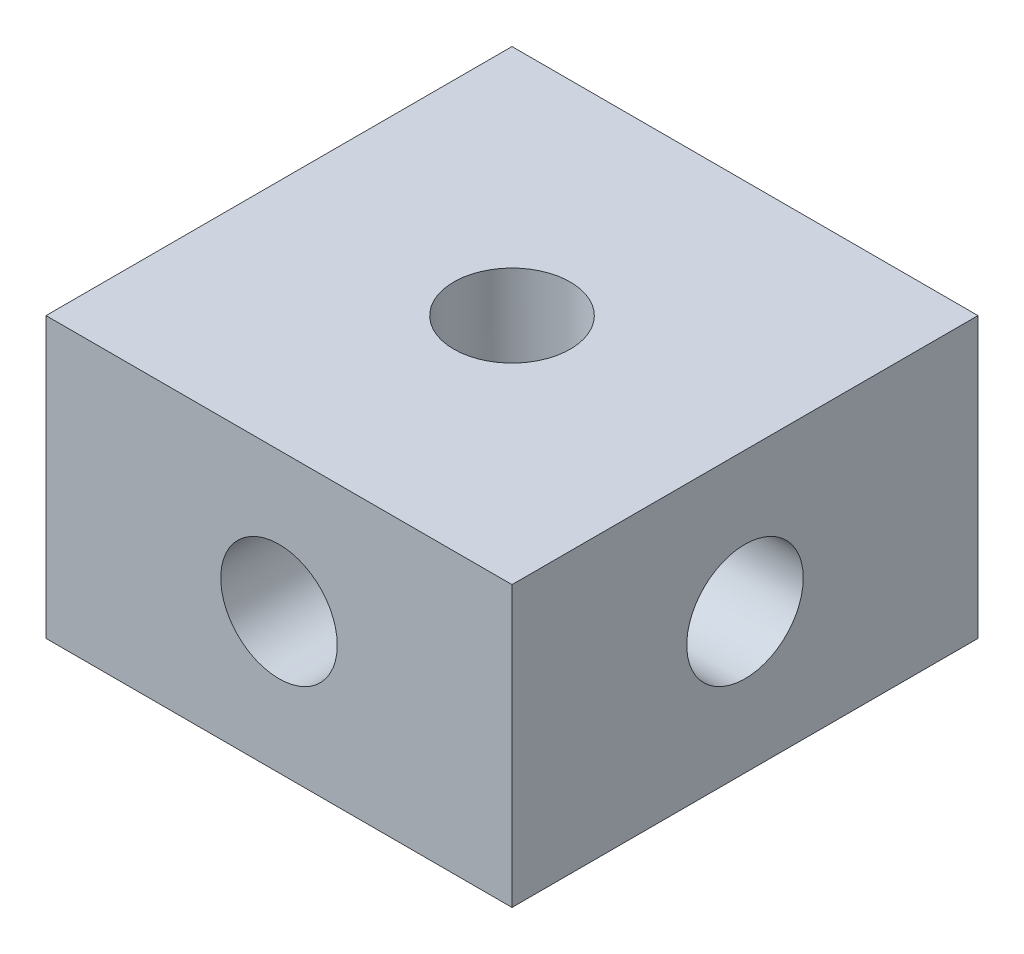
ISO-10303-21;
HEADER;
FILE_DESCRIPTION(('STEP AP214'),'2;1');
FILE_NAME('part.step','',(''),(''),'','','');
FILE_SCHEMA(('AUTOMOTIVE_DESIGN { 1 0 10303 214 1 1 1 1 }'));
ENDSEC;
DATA;
#1=APPLICATION_CONTEXT('core data for automotive mechanical design processes');
#2=APPLICATION_PROTOCOL_DEFINITION('international standard','automotive_design',2000,#1);
#3=PRODUCT_CONTEXT('',#1,'mechanical');
#4=PRODUCT('Part','Part','',(#3));
#5=PRODUCT_RELATED_PRODUCT_CATEGORY('part','',(#4));
#6=PRODUCT_DEFINITION_FORMATION('','',#4);
#7=PRODUCT_DEFINITION_CONTEXT('part definition',#1,'design');
#8=PRODUCT_DEFINITION('design','',#6,#7);
#9=PRODUCT_DEFINITION_SHAPE('','',#8);
#10=(LENGTH_UNIT() NAMED_UNIT(*) SI_UNIT(.MILLI.,.METRE.));
#11=(NAMED_UNIT(*) PLANE_ANGLE_UNIT() SI_UNIT($,.RADIAN.));
#12=(NAMED_UNIT(*) SI_UNIT($,.STERADIAN.) SOLID_ANGLE_UNIT());
#13=UNCERTAINTY_MEASURE_WITH_UNIT(LENGTH_MEASURE(1.E-05),#10,'distance_accuracy_value','');
#14=(GEOMETRIC_REPRESENTATION_CONTEXT(3) GLOBAL_UNCERTAINTY_ASSIGNED_CONTEXT((#13)) GLOBAL_UNIT_ASSIGNED_CONTEXT((#10,
#11,#12)) REPRESENTATION_CONTEXT('',''));
#15=CARTESIAN_POINT('',(0.,0.,0.));
#16=DIRECTION('',(0.,0.,1.));
#17=DIRECTION('',(1.,0.,0.));
#18=AXIS2_PLACEMENT_3D('',#15,#16,#17);
#19=CARTESIAN_POINT('',(0.,-3.,0.));
#20=DIRECTION('',(0.,1.,0.));
#21=DIRECTION('',(0.,0.,1.));
#22=AXIS2_PLACEMENT_3D('',#19,#20,#21);
#23=CYLINDRICAL_SURFACE('',#22,1.25);
#24=CARTESIAN_POINT('',(0.,3.,0.));
#25=DIRECTION('',(0.,1.,0.));
#26=DIRECTION('',(0.,0.,1.));
#27=AXIS2_PLACEMENT_3D('',#24,#25,#26);
#28=CIRCLE('',#27,1.25);
#29=CARTESIAN_POINT('',(0.,3.,1.25));
#30=VERTEX_POINT('',#29);
#31=EDGE_CURVE('E154',#30,#30,#28,.T.);
#32=ORIENTED_EDGE('',*,*,#31,.T.);
#33=EDGE_LOOP('',(#32));
#34=FACE_BOUND('',#33,.T.);
#35=CARTESIAN_POINT('',(0.,0.,0.));
#36=DIRECTION('',(0.,0.707106781186547,-0.707106781186547));
#37=DIRECTION('',(0.,0.707106781186547,0.707106781186547));
#38=AXIS2_PLACEMENT_3D('',#35,#36,#37);
#39=ELLIPSE('',#38,1.76776695296637,1.25);
#40=CARTESIAN_POINT('',(0.883883476483184,0.883883476483184,0.883883476483184));
#41=VERTEX_POINT('',#40);
#42=CARTESIAN_POINT('',(-0.883883476483184,0.883883476483184,0.883883476483184));
#43=VERTEX_POINT('',#42);
#44=EDGE_CURVE('E111',#41,#43,#39,.F.);
#45=ORIENTED_EDGE('',*,*,#44,.T.);
#46=CARTESIAN_POINT('',(0.,0.,0.));
#47=DIRECTION('',(0.707106781186547,0.707106781186547,0.));
#48=DIRECTION('',(-0.707106781186547,0.707106781186547,0.));
#49=AXIS2_PLACEMENT_3D('',#46,#47,#48);
#50=ELLIPSE('',#49,1.76776695296637,1.25);
#51=CARTESIAN_POINT('',(-0.883883476483184,0.883883476483184,-0.883883476483184));
#52=VERTEX_POINT('',#51);
#53=EDGE_CURVE('E100',#43,#52,#50,.F.);
#54=ORIENTED_EDGE('',*,*,#53,.T.);
#55=CARTESIAN_POINT('',(0.,0.,0.));
#56=DIRECTION('',(0.,0.707106781186547,0.707106781186547));
#57=DIRECTION('',(0.,0.707106781186547,-0.707106781186547));
#58=AXIS2_PLACEMENT_3D('',#55,#56,#57);
#59=ELLIPSE('',#58,1.76776695296637,1.25);
#60=CARTESIAN_POINT('',(0.883883476483184,0.883883476483184,-0.883883476483184));
#61=VERTEX_POINT('',#60);
#62=EDGE_CURVE('E106',#52,#61,#59,.F.);
#63=ORIENTED_EDGE('',*,*,#62,.T.);
#64=CARTESIAN_POINT('',(0.,0.,0.));
#65=DIRECTION('',(-0.707106781186547,0.707106781186547,0.));
#66=DIRECTION('',(0.707106781186547,0.707106781186547,0.));
#67=AXIS2_PLACEMENT_3D('',#64,#65,#66);
#68=ELLIPSE('',#67,1.76776695296637,1.25);
#69=EDGE_CURVE('E52',#61,#41,#68,.F.);
#70=ORIENTED_EDGE('',*,*,#69,.T.);
#71=EDGE_LOOP('',(#45,#54,#63,#70));
#72=FACE_BOUND('',#71,.T.);
#73=ADVANCED_FACE('F37',(#34,#72),#23,.F.);
#74=CARTESIAN_POINT('',(5.,3.,5.));
#75=DIRECTION('',(-1.,0.,0.));
#76=DIRECTION('',(0.,0.,1.));
#77=AXIS2_PLACEMENT_3D('',#74,#75,#76);
#78=PLANE('',#77);
#79=CARTESIAN_POINT('',(5.,0.,0.));
#80=DIRECTION('',(1.,0.,0.));
#81=DIRECTION('',(0.,0.,-1.));
#82=AXIS2_PLACEMENT_3D('',#79,#80,#81);
#83=CIRCLE('',#82,1.25);
#84=CARTESIAN_POINT('',(5.,0.,-1.25));
#85=VERTEX_POINT('',#84);
#86=EDGE_CURVE('E175',#85,#85,#83,.T.);
#87=ORIENTED_EDGE('',*,*,#86,.F.);
#88=EDGE_LOOP('',(#87));
#89=FACE_BOUND('',#88,.T.);
#90=DIRECTION('',(0.,0.,-1.));
#91=VECTOR('',#90,1.);
#92=CARTESIAN_POINT('',(5.,-3.,5.));
#93=LINE('',#92,#91);
#94=CARTESIAN_POINT('',(5.,-3.,5.));
#95=VERTEX_POINT('',#94);
#96=CARTESIAN_POINT('',(5.,-3.,-5.));
#97=VERTEX_POINT('',#96);
#98=EDGE_CURVE('E143',#95,#97,#93,.T.);
#99=ORIENTED_EDGE('',*,*,#98,.T.);
#100=DIRECTION('',(0.,-1.,0.));
#101=VECTOR('',#100,1.);
#102=CARTESIAN_POINT('',(5.,3.,-5.));
#103=LINE('',#102,#101);
#104=CARTESIAN_POINT('',(5.,3.,-5.));
#105=VERTEX_POINT('',#104);
#106=EDGE_CURVE('E123',#105,#97,#103,.T.);
#107=ORIENTED_EDGE('',*,*,#106,.F.);
#108=DIRECTION('',(0.,0.,-1.));
#109=VECTOR('',#108,1.);
#110=CARTESIAN_POINT('',(5.,3.,5.));
#111=LINE('',#110,#109);
#112=CARTESIAN_POINT('',(5.,3.,5.));
#113=VERTEX_POINT('',#112);
#114=EDGE_CURVE('E138',#113,#105,#111,.T.);
#115=ORIENTED_EDGE('',*,*,#114,.F.);
#116=DIRECTION('',(0.,-1.,0.));
#117=VECTOR('',#116,1.);
#118=CARTESIAN_POINT('',(5.,3.,5.));
#119=LINE('',#118,#117);
#120=EDGE_CURVE('E132',#113,#95,#119,.T.);
#121=ORIENTED_EDGE('',*,*,#120,.T.);
#122=EDGE_LOOP('',(#99,#107,#115,#121));
#123=FACE_BOUND('',#122,.T.);
#124=ADVANCED_FACE('F39',(#89,#123),#78,.F.);
#125=CARTESIAN_POINT('',(-5.,3.,-5.));
#126=DIRECTION('',(0.,0.,1.));
#127=DIRECTION('',(1.,0.,0.));
#128=AXIS2_PLACEMENT_3D('',#125,#126,#127);
#129=PLANE('',#128);
#130=CARTESIAN_POINT('',(0.,0.,-5.));
#131=DIRECTION('',(0.,0.,1.));
#132=DIRECTION('',(1.,0.,0.));
#133=AXIS2_PLACEMENT_3D('',#130,#131,#132);
#134=CIRCLE('',#133,1.25);
#135=CARTESIAN_POINT('',(1.25,0.,-5.));
#136=VERTEX_POINT('',#135);
#137=EDGE_CURVE('E157',#136,#136,#134,.T.);
#138=ORIENTED_EDGE('',*,*,#137,.T.);
#139=EDGE_LOOP('',(#138));
#140=FACE_BOUND('',#139,.T.);
#141=DIRECTION('',(-1.,0.,0.));
#142=VECTOR('',#141,1.);
#143=CARTESIAN_POINT('',(-5.,-3.,-5.));
#144=LINE('',#143,#142);
#145=CARTESIAN_POINT('',(-5.,-3.,-5.));
#146=VERTEX_POINT('',#145);
#147=EDGE_CURVE('E141',#97,#146,#144,.T.);
#148=ORIENTED_EDGE('',*,*,#147,.T.);
#149=DIRECTION('',(0.,-1.,0.));
#150=VECTOR('',#149,1.);
#151=CARTESIAN_POINT('',(-5.,3.,-5.));
#152=LINE('',#151,#150);
#153=CARTESIAN_POINT('',(-5.,3.,-5.));
#154=VERTEX_POINT('',#153);
#155=EDGE_CURVE('E126',#154,#146,#152,.T.);
#156=ORIENTED_EDGE('',*,*,#155,.F.);
#157=DIRECTION('',(-1.,0.,0.));
#158=VECTOR('',#157,1.);
#159=CARTESIAN_POINT('',(-5.,3.,-5.));
#160=LINE('',#159,#158);
#161=EDGE_CURVE('E150',#105,#154,#160,.T.);
#162=ORIENTED_EDGE('',*,*,#161,.F.);
#163=ORIENTED_EDGE('',*,*,#106,.T.);
#164=EDGE_LOOP('',(#148,#156,#162,#163));
#165=FACE_BOUND('',#164,.T.);
#166=ADVANCED_FACE('F202',(#140,#165),#129,.F.);
#167=CARTESIAN_POINT('',(-5.,3.,5.));
#168=DIRECTION('',(1.,0.,0.));
#169=DIRECTION('',(0.,0.,-1.));
#170=AXIS2_PLACEMENT_3D('',#167,#168,#169);
#171=PLANE('',#170);
#172=CARTESIAN_POINT('',(-5.,0.,0.));
#173=DIRECTION('',(1.,0.,0.));
#174=DIRECTION('',(0.,0.,-1.));
#175=AXIS2_PLACEMENT_3D('',#172,#173,#174);
#176=CIRCLE('',#175,1.25);
#177=CARTESIAN_POINT('',(-5.,0.,-1.25));
#178=VERTEX_POINT('',#177);
#179=EDGE_CURVE('E174',#178,#178,#176,.T.);
#180=ORIENTED_EDGE('',*,*,#179,.T.);
#181=EDGE_LOOP('',(#180));
#182=FACE_BOUND('',#181,.T.);
#183=DIRECTION('',(0.,0.,1.));
#184=VECTOR('',#183,1.);
#185=CARTESIAN_POINT('',(-5.,-3.,5.));
#186=LINE('',#185,#184);
#187=CARTESIAN_POINT('',(-5.,-3.,5.));
#188=VERTEX_POINT('',#187);
#189=EDGE_CURVE('E139',#146,#188,#186,.T.);
#190=ORIENTED_EDGE('',*,*,#189,.T.);
#191=DIRECTION('',(0.,-1.,0.));
#192=VECTOR('',#191,1.);
#193=CARTESIAN_POINT('',(-5.,3.,5.));
#194=LINE('',#193,#192);
#195=CARTESIAN_POINT('',(-5.,3.,5.));
#196=VERTEX_POINT('',#195);
#197=EDGE_CURVE('E129',#196,#188,#194,.T.);
#198=ORIENTED_EDGE('',*,*,#197,.F.);
#199=DIRECTION('',(0.,0.,1.));
#200=VECTOR('',#199,1.);
#201=CARTESIAN_POINT('',(-5.,3.,5.));
#202=LINE('',#201,#200);
#203=EDGE_CURVE('E148',#154,#196,#202,.T.);
#204=ORIENTED_EDGE('',*,*,#203,.F.);
#205=ORIENTED_EDGE('',*,*,#155,.T.);
#206=EDGE_LOOP('',(#190,#198,#204,#205));
#207=FACE_BOUND('',#206,.T.);
#208=ADVANCED_FACE('F181',(#182,#207),#171,.F.);
#209=CARTESIAN_POINT('',(-5.,3.,5.));
#210=DIRECTION('',(0.,0.,-1.));
#211=DIRECTION('',(-1.,0.,0.));
#212=AXIS2_PLACEMENT_3D('',#209,#210,#211);
#213=PLANE('',#212);
#214=CARTESIAN_POINT('',(0.,0.,5.));
#215=DIRECTION('',(0.,0.,1.));
#216=DIRECTION('',(1.,0.,0.));
#217=AXIS2_PLACEMENT_3D('',#214,#215,#216);
#218=CIRCLE('',#217,1.25);
#219=CARTESIAN_POINT('',(1.25,0.,5.));
#220=VERTEX_POINT('',#219);
#221=EDGE_CURVE('E160',#220,#220,#218,.T.);
#222=ORIENTED_EDGE('',*,*,#221,.F.);
#223=EDGE_LOOP('',(#222));
#224=FACE_BOUND('',#223,.T.);
#225=DIRECTION('',(1.,0.,0.));
#226=VECTOR('',#225,1.);
#227=CARTESIAN_POINT('',(-5.,-3.,5.));
#228=LINE('',#227,#226);
#229=EDGE_CURVE('E136',#188,#95,#228,.T.);
#230=ORIENTED_EDGE('',*,*,#229,.T.);
#231=ORIENTED_EDGE('',*,*,#120,.F.);
#232=DIRECTION('',(1.,0.,0.));
#233=VECTOR('',#232,1.);
#234=CARTESIAN_POINT('',(-5.,3.,5.));
#235=LINE('',#234,#233);
#236=EDGE_CURVE('E135',#196,#113,#235,.T.);
#237=ORIENTED_EDGE('',*,*,#236,.F.);
#238=ORIENTED_EDGE('',*,*,#197,.T.);
#239=EDGE_LOOP('',(#230,#231,#237,#238));
#240=FACE_BOUND('',#239,.T.);
#241=ADVANCED_FACE('F229',(#224,#240),#213,.F.);
#242=CARTESIAN_POINT('',(0.,3.,0.));
#243=DIRECTION('',(0.,-1.,0.));
#244=DIRECTION('',(0.,0.,-1.));
#245=AXIS2_PLACEMENT_3D('',#242,#243,#244);
#246=PLANE('',#245);
#247=ORIENTED_EDGE('',*,*,#31,.F.);
#248=EDGE_LOOP('',(#247));
#249=FACE_BOUND('',#248,.T.);
#250=ORIENTED_EDGE('',*,*,#114,.T.);
#251=ORIENTED_EDGE('',*,*,#161,.T.);
#252=ORIENTED_EDGE('',*,*,#203,.T.);
#253=ORIENTED_EDGE('',*,*,#236,.T.);
#254=EDGE_LOOP('',(#250,#251,#252,#253));
#255=FACE_BOUND('',#254,.T.);
#256=ADVANCED_FACE('F213',(#249,#255),#246,.F.);
#257=CARTESIAN_POINT('',(0.,-3.,0.));
#258=DIRECTION('',(0.,-1.,0.));
#259=DIRECTION('',(0.,0.,-1.));
#260=AXIS2_PLACEMENT_3D('',#257,#258,#259);
#261=PLANE('',#260);
#262=CARTESIAN_POINT('',(0.,-3.,0.));
#263=DIRECTION('',(0.,1.,0.));
#264=DIRECTION('',(0.,0.,1.));
#265=AXIS2_PLACEMENT_3D('',#262,#263,#264);
#266=CIRCLE('',#265,1.25);
#267=CARTESIAN_POINT('',(0.,-3.,1.25));
#268=VERTEX_POINT('',#267);
#269=EDGE_CURVE('E146',#268,#268,#266,.T.);
#270=ORIENTED_EDGE('',*,*,#269,.T.);
#271=EDGE_LOOP('',(#270));
#272=FACE_BOUND('',#271,.T.);
#273=ORIENTED_EDGE('',*,*,#98,.F.);
#274=ORIENTED_EDGE('',*,*,#229,.F.);
#275=ORIENTED_EDGE('',*,*,#189,.F.);
#276=ORIENTED_EDGE('',*,*,#147,.F.);
#277=EDGE_LOOP('',(#273,#274,#275,#276));
#278=FACE_BOUND('',#277,.T.);
#279=ADVANCED_FACE('F206',(#272,#278),#261,.T.);
#280=CARTESIAN_POINT('',(0.,0.,0.));
#281=DIRECTION('',(0.,0.707106781186547,0.707106781186547));
#282=DIRECTION('',(0.,0.707106781186547,-0.707106781186547));
#283=AXIS2_PLACEMENT_3D('',#280,#281,#282);
#284=ELLIPSE('',#283,1.76776695296637,1.25);
#285=CARTESIAN_POINT('',(-0.883883476483184,-0.883883476483184,0.883883476483184));
#286=VERTEX_POINT('',#285);
#287=CARTESIAN_POINT('',(0.883883476483184,-0.883883476483184,0.883883476483184));
#288=VERTEX_POINT('',#287);
#289=EDGE_CURVE('E115',#286,#288,#284,.T.);
#290=ORIENTED_EDGE('',*,*,#289,.T.);
#291=CARTESIAN_POINT('',(0.,0.,0.));
#292=DIRECTION('',(0.707106781186547,0.707106781186547,0.));
#293=DIRECTION('',(-0.707106781186547,0.707106781186547,0.));
#294=AXIS2_PLACEMENT_3D('',#291,#292,#293);
#295=ELLIPSE('',#294,1.76776695296637,1.25);
#296=CARTESIAN_POINT('',(0.883883476483184,-0.883883476483184,-0.883883476483184));
#297=VERTEX_POINT('',#296);
#298=EDGE_CURVE('E169',#288,#297,#295,.T.);
#299=ORIENTED_EDGE('',*,*,#298,.T.);
#300=CARTESIAN_POINT('',(0.,0.,0.));
#301=DIRECTION('',(0.,0.707106781186547,-0.707106781186547));
#302=DIRECTION('',(0.,0.707106781186547,0.707106781186547));
#303=AXIS2_PLACEMENT_3D('',#300,#301,#302);
#304=ELLIPSE('',#303,1.76776695296637,1.25);
#305=CARTESIAN_POINT('',(-0.883883476483184,-0.883883476483184,-0.883883476483184));
#306=VERTEX_POINT('',#305);
#307=EDGE_CURVE('E118',#297,#306,#304,.T.);
#308=ORIENTED_EDGE('',*,*,#307,.T.);
#309=CARTESIAN_POINT('',(0.,0.,0.));
#310=DIRECTION('',(-0.707106781186547,0.707106781186547,0.));
#311=DIRECTION('',(0.707106781186547,0.707106781186547,0.));
#312=AXIS2_PLACEMENT_3D('',#309,#310,#311);
#313=ELLIPSE('',#312,1.76776695296637,1.25);
#314=EDGE_CURVE('E59',#306,#286,#313,.T.);
#315=ORIENTED_EDGE('',*,*,#314,.T.);
#316=EDGE_LOOP('',(#290,#299,#308,#315));
#317=FACE_BOUND('',#316,.T.);
#318=ORIENTED_EDGE('',*,*,#269,.F.);
#319=EDGE_LOOP('',(#318));
#320=FACE_BOUND('',#319,.T.);
#321=ADVANCED_FACE('F198',(#317,#320),#23,.F.);
#322=CARTESIAN_POINT('',(0.,0.,-5.));
#323=DIRECTION('',(0.,0.,1.));
#324=DIRECTION('',(1.,0.,0.));
#325=AXIS2_PLACEMENT_3D('',#322,#323,#324);
#326=CYLINDRICAL_SURFACE('',#325,1.25);
#327=ORIENTED_EDGE('',*,*,#221,.T.);
#328=EDGE_LOOP('',(#327));
#329=FACE_BOUND('',#328,.T.);
#330=ORIENTED_EDGE('',*,*,#289,.F.);
#331=CARTESIAN_POINT('',(0.,0.,0.));
#332=DIRECTION('',(0.707106781186547,0.,0.707106781186547));
#333=DIRECTION('',(-0.707106781186547,0.,0.707106781186547));
#334=AXIS2_PLACEMENT_3D('',#331,#332,#333);
#335=ELLIPSE('',#334,1.76776695296637,1.25);
#336=EDGE_CURVE('E112',#286,#43,#335,.F.);
#337=ORIENTED_EDGE('',*,*,#336,.T.);
#338=ORIENTED_EDGE('',*,*,#44,.F.);
#339=CARTESIAN_POINT('',(0.,0.,0.));
#340=DIRECTION('',(-0.707106781186547,0.,0.707106781186547));
#341=DIRECTION('',(0.707106781186547,0.,0.707106781186547));
#342=AXIS2_PLACEMENT_3D('',#339,#340,#341);
#343=ELLIPSE('',#342,1.76776695296637,1.25);
#344=EDGE_CURVE('E163',#41,#288,#343,.F.);
#345=ORIENTED_EDGE('',*,*,#344,.T.);
#346=EDGE_LOOP('',(#330,#337,#338,#345));
#347=FACE_BOUND('',#346,.T.);
#348=ADVANCED_FACE('F192',(#329,#347),#326,.F.);
#349=ORIENTED_EDGE('',*,*,#137,.F.);
#350=EDGE_LOOP('',(#349));
#351=FACE_BOUND('',#350,.T.);
#352=ORIENTED_EDGE('',*,*,#307,.F.);
#353=CARTESIAN_POINT('',(0.,0.,0.));
#354=DIRECTION('',(0.707106781186547,0.,0.707106781186547));
#355=DIRECTION('',(-0.707106781186547,0.,0.707106781186547));
#356=AXIS2_PLACEMENT_3D('',#353,#354,#355);
#357=ELLIPSE('',#356,1.76776695296637,1.25);
#358=EDGE_CURVE('E11',#297,#61,#357,.T.);
#359=ORIENTED_EDGE('',*,*,#358,.T.);
#360=ORIENTED_EDGE('',*,*,#62,.F.);
#361=CARTESIAN_POINT('',(0.,0.,0.));
#362=DIRECTION('',(-0.707106781186547,0.,0.707106781186547));
#363=DIRECTION('',(0.707106781186547,0.,0.707106781186547));
#364=AXIS2_PLACEMENT_3D('',#361,#362,#363);
#365=ELLIPSE('',#364,1.76776695296637,1.25);
#366=EDGE_CURVE('E45',#52,#306,#365,.T.);
#367=ORIENTED_EDGE('',*,*,#366,.T.);
#368=EDGE_LOOP('',(#352,#359,#360,#367));
#369=FACE_BOUND('',#368,.T.);
#370=ADVANCED_FACE('F114',(#351,#369),#326,.F.);
#371=CARTESIAN_POINT('',(-5.,0.,0.));
#372=DIRECTION('',(1.,0.,0.));
#373=DIRECTION('',(0.,0.,-1.));
#374=AXIS2_PLACEMENT_3D('',#371,#372,#373);
#375=CYLINDRICAL_SURFACE('',#374,1.25);
#376=ORIENTED_EDGE('',*,*,#179,.F.);
#377=EDGE_LOOP('',(#376));
#378=FACE_BOUND('',#377,.T.);
#379=ORIENTED_EDGE('',*,*,#314,.F.);
#380=ORIENTED_EDGE('',*,*,#366,.F.);
#381=ORIENTED_EDGE('',*,*,#53,.F.);
#382=ORIENTED_EDGE('',*,*,#336,.F.);
#383=EDGE_LOOP('',(#379,#380,#381,#382));
#384=FACE_BOUND('',#383,.T.);
#385=ADVANCED_FACE('F99',(#378,#384),#375,.F.);
#386=ORIENTED_EDGE('',*,*,#86,.T.);
#387=EDGE_LOOP('',(#386));
#388=FACE_BOUND('',#387,.T.);
#389=ORIENTED_EDGE('',*,*,#69,.F.);
#390=ORIENTED_EDGE('',*,*,#358,.F.);
#391=ORIENTED_EDGE('',*,*,#298,.F.);
#392=ORIENTED_EDGE('',*,*,#344,.F.);
#393=EDGE_LOOP('',(#389,#390,#391,#392));
#394=FACE_BOUND('',#393,.T.);
#395=ADVANCED_FACE('F185',(#388,#394),#375,.F.);
#396=CLOSED_SHELL('',(#73,#124,#166,#208,#241,#256,#279,#321,#348,#370,#385,#395));
#397=MANIFOLD_SOLID_BREP('B2',#396);
#398=ADVANCED_BREP_SHAPE_REPRESENTATION('',(#18,#397),#14);
#399=SHAPE_DEFINITION_REPRESENTATION(#9,#398);
ENDSEC;
END-ISO-10303-21;
